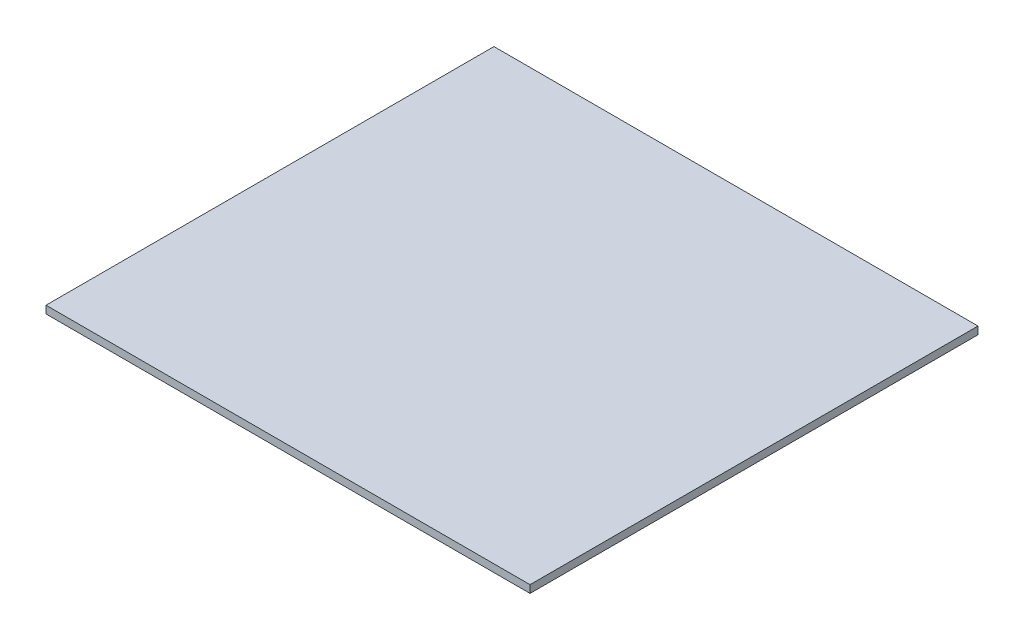
ISO-10303-21;
HEADER;
FILE_DESCRIPTION(('STEP AP214'),'2;1');
FILE_NAME('part.step','',(''),(''),'','','');
FILE_SCHEMA(('AUTOMOTIVE_DESIGN { 1 0 10303 214 1 1 1 1 }'));
ENDSEC;
DATA;
#1=APPLICATION_CONTEXT('core data for automotive mechanical design processes');
#2=APPLICATION_PROTOCOL_DEFINITION('international standard','automotive_design',2000,#1);
#3=PRODUCT_CONTEXT('',#1,'mechanical');
#4=PRODUCT('Part','Part','',(#3));
#5=PRODUCT_RELATED_PRODUCT_CATEGORY('part','',(#4));
#6=PRODUCT_DEFINITION_FORMATION('','',#4);
#7=PRODUCT_DEFINITION_CONTEXT('part definition',#1,'design');
#8=PRODUCT_DEFINITION('design','',#6,#7);
#9=PRODUCT_DEFINITION_SHAPE('','',#8);
#10=(LENGTH_UNIT() NAMED_UNIT(*) SI_UNIT(.MILLI.,.METRE.));
#11=(NAMED_UNIT(*) PLANE_ANGLE_UNIT() SI_UNIT($,.RADIAN.));
#12=(NAMED_UNIT(*) SI_UNIT($,.STERADIAN.) SOLID_ANGLE_UNIT());
#13=UNCERTAINTY_MEASURE_WITH_UNIT(LENGTH_MEASURE(1.E-05),#10,'distance_accuracy_value','');
#14=(GEOMETRIC_REPRESENTATION_CONTEXT(3) GLOBAL_UNCERTAINTY_ASSIGNED_CONTEXT((#13)) GLOBAL_UNIT_ASSIGNED_CONTEXT((#10,
#11,#12)) REPRESENTATION_CONTEXT('',''));
#15=CARTESIAN_POINT('',(0.,0.,0.));
#16=DIRECTION('',(0.,0.,1.));
#17=DIRECTION('',(1.,0.,0.));
#18=AXIS2_PLACEMENT_3D('',#15,#16,#17);
#19=CARTESIAN_POINT('',(404.8125,6.35,374.65));
#20=DIRECTION('',(-1.,0.,0.));
#21=DIRECTION('',(0.,0.,1.));
#22=AXIS2_PLACEMENT_3D('',#19,#20,#21);
#23=PLANE('',#22);
#24=DIRECTION('',(0.,0.,-1.));
#25=VECTOR('',#24,1.);
#26=CARTESIAN_POINT('',(404.8125,-6.35,374.65));
#27=LINE('',#26,#25);
#28=CARTESIAN_POINT('',(404.8125,-6.35,374.65));
#29=VERTEX_POINT('',#28);
#30=CARTESIAN_POINT('',(404.8125,-6.35,-374.65));
#31=VERTEX_POINT('',#30);
#32=EDGE_CURVE('E104',#29,#31,#27,.T.);
#33=ORIENTED_EDGE('',*,*,#32,.T.);
#34=DIRECTION('',(0.,-1.,0.));
#35=VECTOR('',#34,1.);
#36=CARTESIAN_POINT('',(404.8125,6.35,-374.65));
#37=LINE('',#36,#35);
#38=CARTESIAN_POINT('',(404.8125,6.35,-374.65));
#39=VERTEX_POINT('',#38);
#40=EDGE_CURVE('E11',#39,#31,#37,.T.);
#41=ORIENTED_EDGE('',*,*,#40,.F.);
#42=DIRECTION('',(0.,0.,-1.));
#43=VECTOR('',#42,1.);
#44=CARTESIAN_POINT('',(404.8125,6.35,374.65));
#45=LINE('',#44,#43);
#46=CARTESIAN_POINT('',(404.8125,6.35,374.65));
#47=VERTEX_POINT('',#46);
#48=EDGE_CURVE('E92',#47,#39,#45,.T.);
#49=ORIENTED_EDGE('',*,*,#48,.F.);
#50=DIRECTION('',(0.,-1.,0.));
#51=VECTOR('',#50,1.);
#52=CARTESIAN_POINT('',(404.8125,6.35,374.65));
#53=LINE('',#52,#51);
#54=EDGE_CURVE('E100',#47,#29,#53,.T.);
#55=ORIENTED_EDGE('',*,*,#54,.T.);
#56=EDGE_LOOP('',(#33,#41,#49,#55));
#57=FACE_BOUND('',#56,.T.);
#58=ADVANCED_FACE('F41',(#57),#23,.F.);
#59=CARTESIAN_POINT('',(-404.8125,6.35,-374.65));
#60=DIRECTION('',(0.,0.,1.));
#61=DIRECTION('',(1.,0.,0.));
#62=AXIS2_PLACEMENT_3D('',#59,#60,#61);
#63=PLANE('',#62);
#64=DIRECTION('',(-1.,0.,0.));
#65=VECTOR('',#64,1.);
#66=CARTESIAN_POINT('',(-404.8125,-6.35,-374.65));
#67=LINE('',#66,#65);
#68=CARTESIAN_POINT('',(-404.8125,-6.35,-374.65));
#69=VERTEX_POINT('',#68);
#70=EDGE_CURVE('E96',#31,#69,#67,.T.);
#71=ORIENTED_EDGE('',*,*,#70,.T.);
#72=DIRECTION('',(0.,-1.,0.));
#73=VECTOR('',#72,1.);
#74=CARTESIAN_POINT('',(-404.8125,6.35,-374.65));
#75=LINE('',#74,#73);
#76=CARTESIAN_POINT('',(-404.8125,6.35,-374.65));
#77=VERTEX_POINT('',#76);
#78=EDGE_CURVE('E49',#77,#69,#75,.T.);
#79=ORIENTED_EDGE('',*,*,#78,.F.);
#80=DIRECTION('',(-1.,0.,0.));
#81=VECTOR('',#80,1.);
#82=CARTESIAN_POINT('',(-404.8125,6.35,-374.65));
#83=LINE('',#82,#81);
#84=EDGE_CURVE('E87',#39,#77,#83,.T.);
#85=ORIENTED_EDGE('',*,*,#84,.F.);
#86=ORIENTED_EDGE('',*,*,#40,.T.);
#87=EDGE_LOOP('',(#71,#79,#85,#86));
#88=FACE_BOUND('',#87,.T.);
#89=ADVANCED_FACE('F95',(#88),#63,.F.);
#90=CARTESIAN_POINT('',(-404.8125,6.35,374.65));
#91=DIRECTION('',(1.,0.,0.));
#92=DIRECTION('',(0.,0.,-1.));
#93=AXIS2_PLACEMENT_3D('',#90,#91,#92);
#94=PLANE('',#93);
#95=DIRECTION('',(0.,0.,1.));
#96=VECTOR('',#95,1.);
#97=CARTESIAN_POINT('',(-404.8125,-6.35,374.65));
#98=LINE('',#97,#96);
#99=CARTESIAN_POINT('',(-404.8125,-6.35,374.65));
#100=VERTEX_POINT('',#99);
#101=EDGE_CURVE('E74',#69,#100,#98,.T.);
#102=ORIENTED_EDGE('',*,*,#101,.T.);
#103=DIRECTION('',(0.,-1.,0.));
#104=VECTOR('',#103,1.);
#105=CARTESIAN_POINT('',(-404.8125,6.35,374.65));
#106=LINE('',#105,#104);
#107=CARTESIAN_POINT('',(-404.8125,6.35,374.65));
#108=VERTEX_POINT('',#107);
#109=EDGE_CURVE('E97',#108,#100,#106,.T.);
#110=ORIENTED_EDGE('',*,*,#109,.F.);
#111=DIRECTION('',(0.,0.,1.));
#112=VECTOR('',#111,1.);
#113=CARTESIAN_POINT('',(-404.8125,6.35,374.65));
#114=LINE('',#113,#112);
#115=EDGE_CURVE('E90',#77,#108,#114,.T.);
#116=ORIENTED_EDGE('',*,*,#115,.F.);
#117=ORIENTED_EDGE('',*,*,#78,.T.);
#118=EDGE_LOOP('',(#102,#110,#116,#117));
#119=FACE_BOUND('',#118,.T.);
#120=ADVANCED_FACE('F98',(#119),#94,.F.);
#121=CARTESIAN_POINT('',(-404.8125,6.35,374.65));
#122=DIRECTION('',(0.,0.,-1.));
#123=DIRECTION('',(-1.,0.,0.));
#124=AXIS2_PLACEMENT_3D('',#121,#122,#123);
#125=PLANE('',#124);
#126=DIRECTION('',(1.,0.,0.));
#127=VECTOR('',#126,1.);
#128=CARTESIAN_POINT('',(-404.8125,-6.35,374.65));
#129=LINE('',#128,#127);
#130=EDGE_CURVE('E80',#100,#29,#129,.T.);
#131=ORIENTED_EDGE('',*,*,#130,.T.);
#132=ORIENTED_EDGE('',*,*,#54,.F.);
#133=DIRECTION('',(1.,0.,0.));
#134=VECTOR('',#133,1.);
#135=CARTESIAN_POINT('',(-404.8125,6.35,374.65));
#136=LINE('',#135,#134);
#137=EDGE_CURVE('E57',#108,#47,#136,.T.);
#138=ORIENTED_EDGE('',*,*,#137,.F.);
#139=ORIENTED_EDGE('',*,*,#109,.T.);
#140=EDGE_LOOP('',(#131,#132,#138,#139));
#141=FACE_BOUND('',#140,.T.);
#142=ADVANCED_FACE('F111',(#141),#125,.F.);
#143=CARTESIAN_POINT('',(0.,6.35,0.));
#144=DIRECTION('',(0.,-1.,0.));
#145=DIRECTION('',(0.,0.,-1.));
#146=AXIS2_PLACEMENT_3D('',#143,#144,#145);
#147=PLANE('',#146);
#148=ORIENTED_EDGE('',*,*,#48,.T.);
#149=ORIENTED_EDGE('',*,*,#84,.T.);
#150=ORIENTED_EDGE('',*,*,#115,.T.);
#151=ORIENTED_EDGE('',*,*,#137,.T.);
#152=EDGE_LOOP('',(#148,#149,#150,#151));
#153=FACE_BOUND('',#152,.T.);
#154=ADVANCED_FACE('F88',(#153),#147,.F.);
#155=CARTESIAN_POINT('',(0.,-6.35,0.));
#156=DIRECTION('',(0.,-1.,0.));
#157=DIRECTION('',(0.,0.,-1.));
#158=AXIS2_PLACEMENT_3D('',#155,#156,#157);
#159=PLANE('',#158);
#160=ORIENTED_EDGE('',*,*,#32,.F.);
#161=ORIENTED_EDGE('',*,*,#130,.F.);
#162=ORIENTED_EDGE('',*,*,#101,.F.);
#163=ORIENTED_EDGE('',*,*,#70,.F.);
#164=EDGE_LOOP('',(#160,#161,#162,#163));
#165=FACE_BOUND('',#164,.T.);
#166=ADVANCED_FACE('F114',(#165),#159,.T.);
#167=CLOSED_SHELL('',(#58,#89,#120,#142,#154,#166));
#168=MANIFOLD_SOLID_BREP('B2',#167);
#169=ADVANCED_BREP_SHAPE_REPRESENTATION('',(#18,#168),#14);
#170=SHAPE_DEFINITION_REPRESENTATION(#9,#169);
ENDSEC;
END-ISO-10303-21;
